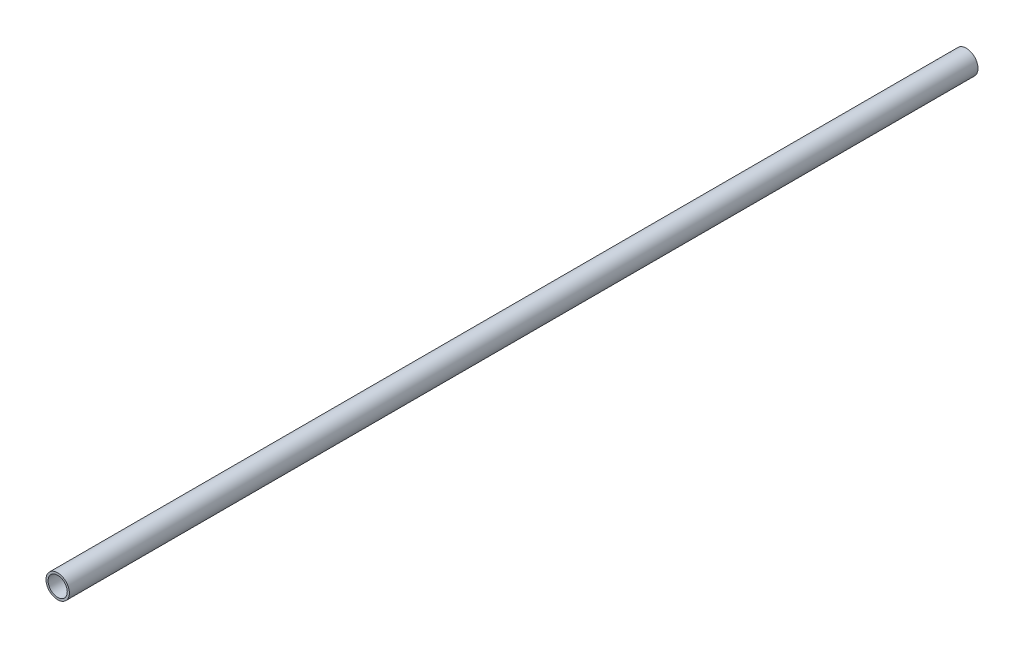
ISO-10303-21;
HEADER;
FILE_DESCRIPTION(('STEP AP214'),'2;1');
FILE_NAME('part.step','',(''),(''),'','','');
FILE_SCHEMA(('AUTOMOTIVE_DESIGN { 1 0 10303 214 1 1 1 1 }'));
ENDSEC;
DATA;
#1=APPLICATION_CONTEXT('core data for automotive mechanical design processes');
#2=APPLICATION_PROTOCOL_DEFINITION('international standard','automotive_design',2000,#1);
#3=PRODUCT_CONTEXT('',#1,'mechanical');
#4=PRODUCT('Part','Part','',(#3));
#5=PRODUCT_RELATED_PRODUCT_CATEGORY('part','',(#4));
#6=PRODUCT_DEFINITION_FORMATION('','',#4);
#7=PRODUCT_DEFINITION_CONTEXT('part definition',#1,'design');
#8=PRODUCT_DEFINITION('design','',#6,#7);
#9=PRODUCT_DEFINITION_SHAPE('','',#8);
#10=(LENGTH_UNIT() NAMED_UNIT(*) SI_UNIT(.MILLI.,.METRE.));
#11=(NAMED_UNIT(*) PLANE_ANGLE_UNIT() SI_UNIT($,.RADIAN.));
#12=(NAMED_UNIT(*) SI_UNIT($,.STERADIAN.) SOLID_ANGLE_UNIT());
#13=UNCERTAINTY_MEASURE_WITH_UNIT(LENGTH_MEASURE(1.E-05),#10,'distance_accuracy_value','');
#14=(GEOMETRIC_REPRESENTATION_CONTEXT(3) GLOBAL_UNCERTAINTY_ASSIGNED_CONTEXT((#13)) GLOBAL_UNIT_ASSIGNED_CONTEXT((#10,
#11,#12)) REPRESENTATION_CONTEXT('',''));
#15=CARTESIAN_POINT('',(0.,0.,0.));
#16=DIRECTION('',(0.,0.,1.));
#17=DIRECTION('',(1.,0.,0.));
#18=AXIS2_PLACEMENT_3D('',#15,#16,#17);
#19=CARTESIAN_POINT('',(0.,0.,5486.4));
#20=DIRECTION('',(0.,0.,1.));
#21=DIRECTION('',(1.,0.,0.));
#22=AXIS2_PLACEMENT_3D('',#19,#20,#21);
#23=PLANE('',#22);
#24=CARTESIAN_POINT('',(0.,0.,5486.4));
#25=DIRECTION('',(0.,0.,1.));
#26=DIRECTION('',(1.,0.,0.));
#27=AXIS2_PLACEMENT_3D('',#24,#25,#26);
#28=CIRCLE('',#27,70.612);
#29=CARTESIAN_POINT('',(70.612,0.,5486.4));
#30=VERTEX_POINT('',#29);
#31=EDGE_CURVE('E10',#30,#30,#28,.T.);
#32=ORIENTED_EDGE('',*,*,#31,.T.);
#33=EDGE_LOOP('',(#32));
#34=FACE_BOUND('',#33,.T.);
#35=CARTESIAN_POINT('',(0.,0.,5486.4));
#36=DIRECTION('',(0.,0.,1.));
#37=DIRECTION('',(1.,0.,0.));
#38=AXIS2_PLACEMENT_3D('',#35,#36,#37);
#39=CIRCLE('',#38,57.912);
#40=CARTESIAN_POINT('',(57.912,0.,5486.4));
#41=VERTEX_POINT('',#40);
#42=EDGE_CURVE('E39',#41,#41,#39,.T.);
#43=ORIENTED_EDGE('',*,*,#42,.F.);
#44=EDGE_LOOP('',(#43));
#45=FACE_BOUND('',#44,.T.);
#46=ADVANCED_FACE('F28',(#34,#45),#23,.T.);
#47=CARTESIAN_POINT('',(0.,0.,0.));
#48=DIRECTION('',(0.,0.,1.));
#49=DIRECTION('',(1.,0.,0.));
#50=AXIS2_PLACEMENT_3D('',#47,#48,#49);
#51=PLANE('',#50);
#52=CARTESIAN_POINT('',(0.,0.,0.));
#53=DIRECTION('',(0.,0.,1.));
#54=DIRECTION('',(1.,0.,0.));
#55=AXIS2_PLACEMENT_3D('',#52,#53,#54);
#56=CIRCLE('',#55,70.612);
#57=CARTESIAN_POINT('',(70.612,0.,0.));
#58=VERTEX_POINT('',#57);
#59=EDGE_CURVE('E32',#58,#58,#56,.T.);
#60=ORIENTED_EDGE('',*,*,#59,.F.);
#61=EDGE_LOOP('',(#60));
#62=FACE_BOUND('',#61,.T.);
#63=CARTESIAN_POINT('',(0.,0.,0.));
#64=DIRECTION('',(0.,0.,1.));
#65=DIRECTION('',(1.,0.,0.));
#66=AXIS2_PLACEMENT_3D('',#63,#64,#65);
#67=CIRCLE('',#66,57.912);
#68=CARTESIAN_POINT('',(57.912,0.,0.));
#69=VERTEX_POINT('',#68);
#70=EDGE_CURVE('E41',#69,#69,#67,.T.);
#71=ORIENTED_EDGE('',*,*,#70,.T.);
#72=EDGE_LOOP('',(#71));
#73=FACE_BOUND('',#72,.T.);
#74=ADVANCED_FACE('F51',(#62,#73),#51,.F.);
#75=CARTESIAN_POINT('',(0.,0.,5486.4));
#76=DIRECTION('',(0.,0.,-1.));
#77=DIRECTION('',(-1.,0.,0.));
#78=AXIS2_PLACEMENT_3D('',#75,#76,#77);
#79=CYLINDRICAL_SURFACE('',#78,70.612);
#80=ORIENTED_EDGE('',*,*,#31,.F.);
#81=EDGE_LOOP('',(#80));
#82=FACE_BOUND('',#81,.T.);
#83=ORIENTED_EDGE('',*,*,#59,.T.);
#84=EDGE_LOOP('',(#83));
#85=FACE_BOUND('',#84,.T.);
#86=ADVANCED_FACE('F30',(#82,#85),#79,.T.);
#87=CARTESIAN_POINT('',(0.,0.,5486.4));
#88=DIRECTION('',(0.,0.,-1.));
#89=DIRECTION('',(-1.,0.,0.));
#90=AXIS2_PLACEMENT_3D('',#87,#88,#89);
#91=CYLINDRICAL_SURFACE('',#90,57.912);
#92=ORIENTED_EDGE('',*,*,#42,.T.);
#93=EDGE_LOOP('',(#92));
#94=FACE_BOUND('',#93,.T.);
#95=ORIENTED_EDGE('',*,*,#70,.F.);
#96=EDGE_LOOP('',(#95));
#97=FACE_BOUND('',#96,.T.);
#98=ADVANCED_FACE('F47',(#94,#97),#91,.F.);
#99=CLOSED_SHELL('',(#46,#74,#86,#98));
#100=MANIFOLD_SOLID_BREP('B2',#99);
#101=ADVANCED_BREP_SHAPE_REPRESENTATION('',(#18,#100),#14);
#102=SHAPE_DEFINITION_REPRESENTATION(#9,#101);
ENDSEC;
END-ISO-10303-21;
